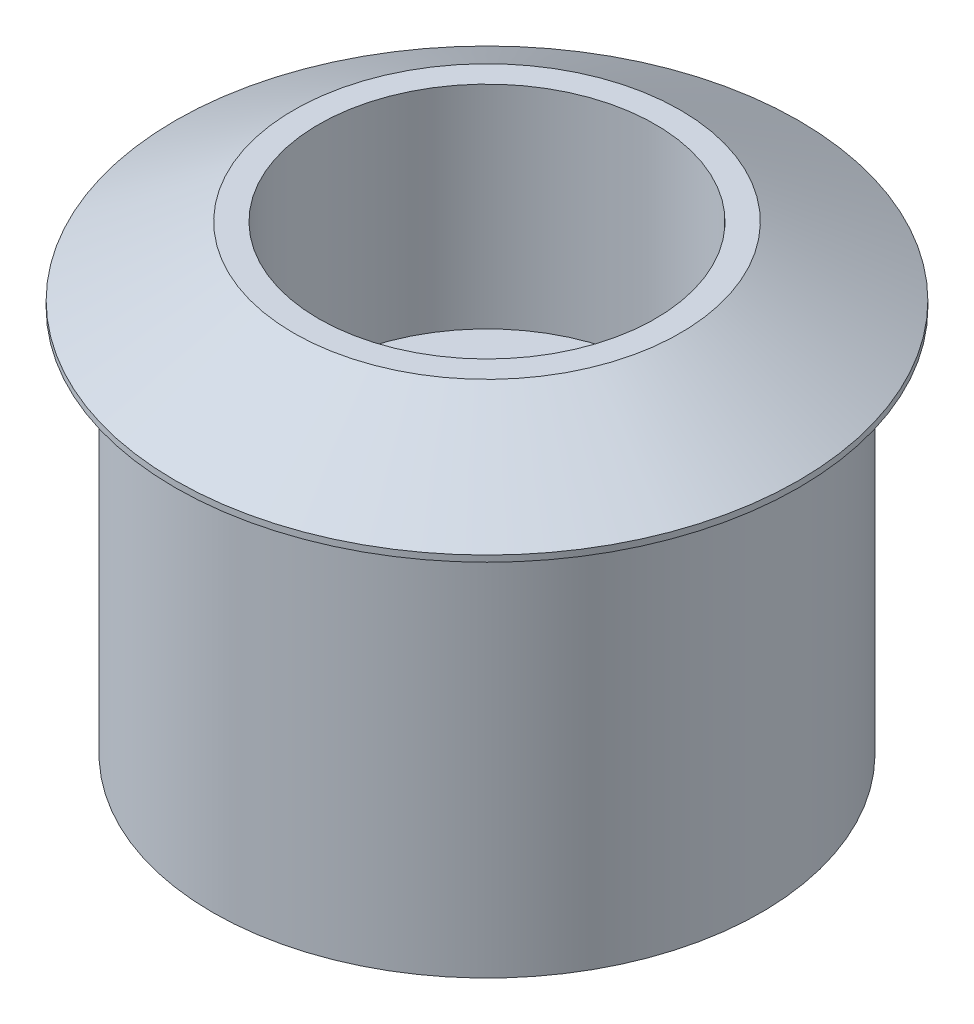
ISO-10303-21;
HEADER;
FILE_DESCRIPTION(('STEP AP214'),'2;1');
FILE_NAME('part.step','',(''),(''),'','','');
FILE_SCHEMA(('AUTOMOTIVE_DESIGN { 1 0 10303 214 1 1 1 1 }'));
ENDSEC;
DATA;
#1=APPLICATION_CONTEXT('core data for automotive mechanical design processes');
#2=APPLICATION_PROTOCOL_DEFINITION('international standard','automotive_design',2000,#1);
#3=PRODUCT_CONTEXT('',#1,'mechanical');
#4=PRODUCT('Part','Part','',(#3));
#5=PRODUCT_RELATED_PRODUCT_CATEGORY('part','',(#4));
#6=PRODUCT_DEFINITION_FORMATION('','',#4);
#7=PRODUCT_DEFINITION_CONTEXT('part definition',#1,'design');
#8=PRODUCT_DEFINITION('design','',#6,#7);
#9=PRODUCT_DEFINITION_SHAPE('','',#8);
#10=(LENGTH_UNIT() NAMED_UNIT(*) SI_UNIT(.MILLI.,.METRE.));
#11=(NAMED_UNIT(*) PLANE_ANGLE_UNIT() SI_UNIT($,.RADIAN.));
#12=(NAMED_UNIT(*) SI_UNIT($,.STERADIAN.) SOLID_ANGLE_UNIT());
#13=UNCERTAINTY_MEASURE_WITH_UNIT(LENGTH_MEASURE(1.E-05),#10,'distance_accuracy_value','');
#14=(GEOMETRIC_REPRESENTATION_CONTEXT(3) GLOBAL_UNCERTAINTY_ASSIGNED_CONTEXT((#13)) GLOBAL_UNIT_ASSIGNED_CONTEXT((#10,
#11,#12)) REPRESENTATION_CONTEXT('',''));
#15=CARTESIAN_POINT('',(0.,0.,0.));
#16=DIRECTION('',(0.,0.,1.));
#17=DIRECTION('',(1.,0.,0.));
#18=AXIS2_PLACEMENT_3D('',#15,#16,#17);
#19=CARTESIAN_POINT('',(0.,10.7305312494731,0.));
#20=DIRECTION('',(0.,1.,0.));
#21=DIRECTION('',(0.,0.,1.));
#22=AXIS2_PLACEMENT_3D('',#19,#20,#21);
#23=CYLINDRICAL_SURFACE('',#22,12.5);
#24=CARTESIAN_POINT('',(0.,15.75,0.));
#25=DIRECTION('',(0.,1.,0.));
#26=DIRECTION('',(0.,0.,1.));
#27=AXIS2_PLACEMENT_3D('',#24,#25,#26);
#28=CIRCLE('',#27,12.5);
#29=CARTESIAN_POINT('',(0.,15.75,12.5));
#30=VERTEX_POINT('',#29);
#31=EDGE_CURVE('E64',#30,#30,#28,.T.);
#32=ORIENTED_EDGE('',*,*,#31,.F.);
#33=EDGE_LOOP('',(#32));
#34=FACE_BOUND('',#33,.T.);
#35=CARTESIAN_POINT('',(0.,15.5,0.));
#36=DIRECTION('',(0.,1.,0.));
#37=DIRECTION('',(0.,0.,1.));
#38=AXIS2_PLACEMENT_3D('',#35,#36,#37);
#39=CIRCLE('',#38,12.5);
#40=CARTESIAN_POINT('',(0.,15.5,12.5));
#41=VERTEX_POINT('',#40);
#42=EDGE_CURVE('E10',#41,#41,#39,.T.);
#43=ORIENTED_EDGE('',*,*,#42,.T.);
#44=EDGE_LOOP('',(#43));
#45=FACE_BOUND('',#44,.T.);
#46=ADVANCED_FACE('F33',(#34,#45),#23,.T.);
#47=CARTESIAN_POINT('',(11.,15.5,0.));
#48=DIRECTION('',(0.,1.,0.));
#49=DIRECTION('',(0.,0.,1.));
#50=AXIS2_PLACEMENT_3D('',#47,#48,#49);
#51=PLANE('',#50);
#52=ORIENTED_EDGE('',*,*,#42,.F.);
#53=EDGE_LOOP('',(#52));
#54=FACE_BOUND('',#53,.T.);
#55=CARTESIAN_POINT('',(0.,15.5,0.));
#56=DIRECTION('',(0.,1.,0.));
#57=DIRECTION('',(0.,0.,1.));
#58=AXIS2_PLACEMENT_3D('',#55,#56,#57);
#59=CIRCLE('',#58,11.);
#60=CARTESIAN_POINT('',(0.,15.5,11.));
#61=VERTEX_POINT('',#60);
#62=EDGE_CURVE('E39',#61,#61,#59,.T.);
#63=ORIENTED_EDGE('',*,*,#62,.T.);
#64=EDGE_LOOP('',(#63));
#65=FACE_BOUND('',#64,.T.);
#66=ADVANCED_FACE('F71',(#54,#65),#51,.F.);
#67=CARTESIAN_POINT('',(0.,10.7305312494731,0.));
#68=DIRECTION('',(0.,1.,0.));
#69=DIRECTION('',(0.,0.,1.));
#70=AXIS2_PLACEMENT_3D('',#67,#68,#69);
#71=CYLINDRICAL_SURFACE('',#70,11.);
#72=ORIENTED_EDGE('',*,*,#62,.F.);
#73=EDGE_LOOP('',(#72));
#74=FACE_BOUND('',#73,.T.);
#75=CARTESIAN_POINT('',(0.,0.,0.));
#76=DIRECTION('',(0.,1.,0.));
#77=DIRECTION('',(0.,0.,1.));
#78=AXIS2_PLACEMENT_3D('',#75,#76,#77);
#79=CIRCLE('',#78,11.);
#80=CARTESIAN_POINT('',(0.,0.,11.));
#81=VERTEX_POINT('',#80);
#82=EDGE_CURVE('E43',#81,#81,#79,.T.);
#83=ORIENTED_EDGE('',*,*,#82,.T.);
#84=EDGE_LOOP('',(#83));
#85=FACE_BOUND('',#84,.T.);
#86=ADVANCED_FACE('F75',(#74,#85),#71,.T.);
#87=CARTESIAN_POINT('',(4.1,0.,0.));
#88=DIRECTION('',(0.,1.,0.));
#89=DIRECTION('',(0.,0.,1.));
#90=AXIS2_PLACEMENT_3D('',#87,#88,#89);
#91=PLANE('',#90);
#92=ORIENTED_EDGE('',*,*,#82,.F.);
#93=EDGE_LOOP('',(#92));
#94=FACE_BOUND('',#93,.T.);
#95=CARTESIAN_POINT('',(0.,0.,0.));
#96=DIRECTION('',(0.,1.,0.));
#97=DIRECTION('',(0.,0.,1.));
#98=AXIS2_PLACEMENT_3D('',#95,#96,#97);
#99=CIRCLE('',#98,4.1);
#100=CARTESIAN_POINT('',(0.,0.,4.1));
#101=VERTEX_POINT('',#100);
#102=EDGE_CURVE('E47',#101,#101,#99,.T.);
#103=ORIENTED_EDGE('',*,*,#102,.T.);
#104=EDGE_LOOP('',(#103));
#105=FACE_BOUND('',#104,.T.);
#106=ADVANCED_FACE('F80',(#94,#105),#91,.F.);
#107=CARTESIAN_POINT('',(0.,10.7305312494731,0.));
#108=DIRECTION('',(0.,1.,0.));
#109=DIRECTION('',(0.,0.,1.));
#110=AXIS2_PLACEMENT_3D('',#107,#108,#109);
#111=CYLINDRICAL_SURFACE('',#110,4.1);
#112=ORIENTED_EDGE('',*,*,#102,.F.);
#113=EDGE_LOOP('',(#112));
#114=FACE_BOUND('',#113,.T.);
#115=CARTESIAN_POINT('',(0.,9.99241377865071,0.));
#116=DIRECTION('',(0.,1.,0.));
#117=DIRECTION('',(0.,0.,1.));
#118=AXIS2_PLACEMENT_3D('',#115,#116,#117);
#119=CIRCLE('',#118,4.1);
#120=CARTESIAN_POINT('',(0.,9.99241377865071,4.1));
#121=VERTEX_POINT('',#120);
#122=EDGE_CURVE('E52',#121,#121,#119,.T.);
#123=ORIENTED_EDGE('',*,*,#122,.T.);
#124=EDGE_LOOP('',(#123));
#125=FACE_BOUND('',#124,.T.);
#126=ADVANCED_FACE('F86',(#114,#125),#111,.F.);
#127=CARTESIAN_POINT('',(4.1,9.99241377865071,0.));
#128=DIRECTION('',(0.,-1.,0.));
#129=DIRECTION('',(0.,0.,-1.));
#130=AXIS2_PLACEMENT_3D('',#127,#128,#129);
#131=PLANE('',#130);
#132=ORIENTED_EDGE('',*,*,#122,.F.);
#133=EDGE_LOOP('',(#132));
#134=FACE_BOUND('',#133,.T.);
#135=CARTESIAN_POINT('',(0.,9.99241377865071,0.));
#136=DIRECTION('',(0.,1.,0.));
#137=DIRECTION('',(0.,0.,1.));
#138=AXIS2_PLACEMENT_3D('',#135,#136,#137);
#139=CIRCLE('',#138,6.75);
#140=CARTESIAN_POINT('',(0.,9.99241377865071,6.75));
#141=VERTEX_POINT('',#140);
#142=EDGE_CURVE('E55',#141,#141,#139,.T.);
#143=ORIENTED_EDGE('',*,*,#142,.T.);
#144=EDGE_LOOP('',(#143));
#145=FACE_BOUND('',#144,.T.);
#146=ADVANCED_FACE('F90',(#134,#145),#131,.F.);
#147=CARTESIAN_POINT('',(0.,10.7305312494731,0.));
#148=DIRECTION('',(0.,1.,0.));
#149=DIRECTION('',(0.,0.,1.));
#150=AXIS2_PLACEMENT_3D('',#147,#148,#149);
#151=CYLINDRICAL_SURFACE('',#150,6.75);
#152=ORIENTED_EDGE('',*,*,#142,.F.);
#153=EDGE_LOOP('',(#152));
#154=FACE_BOUND('',#153,.T.);
#155=CARTESIAN_POINT('',(0.,18.4924137786507,0.));
#156=DIRECTION('',(0.,1.,0.));
#157=DIRECTION('',(0.,0.,1.));
#158=AXIS2_PLACEMENT_3D('',#155,#156,#157);
#159=CIRCLE('',#158,6.75);
#160=CARTESIAN_POINT('',(0.,18.4924137786507,6.75));
#161=VERTEX_POINT('',#160);
#162=EDGE_CURVE('E58',#161,#161,#159,.T.);
#163=ORIENTED_EDGE('',*,*,#162,.T.);
#164=EDGE_LOOP('',(#163));
#165=FACE_BOUND('',#164,.T.);
#166=ADVANCED_FACE('F94',(#154,#165),#151,.F.);
#167=CARTESIAN_POINT('',(6.75,18.4924137786507,0.));
#168=DIRECTION('',(0.,-1.,0.));
#169=DIRECTION('',(0.,0.,-1.));
#170=AXIS2_PLACEMENT_3D('',#167,#168,#169);
#171=PLANE('',#170);
#172=ORIENTED_EDGE('',*,*,#162,.F.);
#173=EDGE_LOOP('',(#172));
#174=FACE_BOUND('',#173,.T.);
#175=CARTESIAN_POINT('',(0.,18.4924137786507,0.));
#176=DIRECTION('',(0.,1.,0.));
#177=DIRECTION('',(0.,0.,1.));
#178=AXIS2_PLACEMENT_3D('',#175,#176,#177);
#179=CIRCLE('',#178,7.75);
#180=CARTESIAN_POINT('',(0.,18.4924137786507,7.75));
#181=VERTEX_POINT('',#180);
#182=EDGE_CURVE('E61',#181,#181,#179,.T.);
#183=ORIENTED_EDGE('',*,*,#182,.T.);
#184=EDGE_LOOP('',(#183));
#185=FACE_BOUND('',#184,.T.);
#186=ADVANCED_FACE('F98',(#174,#185),#171,.F.);
#187=CARTESIAN_POINT('',(0.,15.75,0.));
#188=DIRECTION('',(0.,-1.,0.));
#189=DIRECTION('',(0.,0.,-1.));
#190=AXIS2_PLACEMENT_3D('',#187,#188,#189);
#191=CONICAL_SURFACE('',#190,12.5,1.0471975511966);
#192=ORIENTED_EDGE('',*,*,#182,.F.);
#193=EDGE_LOOP('',(#192));
#194=FACE_BOUND('',#193,.T.);
#195=ORIENTED_EDGE('',*,*,#31,.T.);
#196=EDGE_LOOP('',(#195));
#197=FACE_BOUND('',#196,.T.);
#198=ADVANCED_FACE('F68',(#194,#197),#191,.T.);
#199=CLOSED_SHELL('',(#46,#66,#86,#106,#126,#146,#166,#186,#198));
#200=MANIFOLD_SOLID_BREP('B2',#199);
#201=ADVANCED_BREP_SHAPE_REPRESENTATION('',(#18,#200),#14);
#202=SHAPE_DEFINITION_REPRESENTATION(#9,#201);
ENDSEC;
END-ISO-10303-21;
